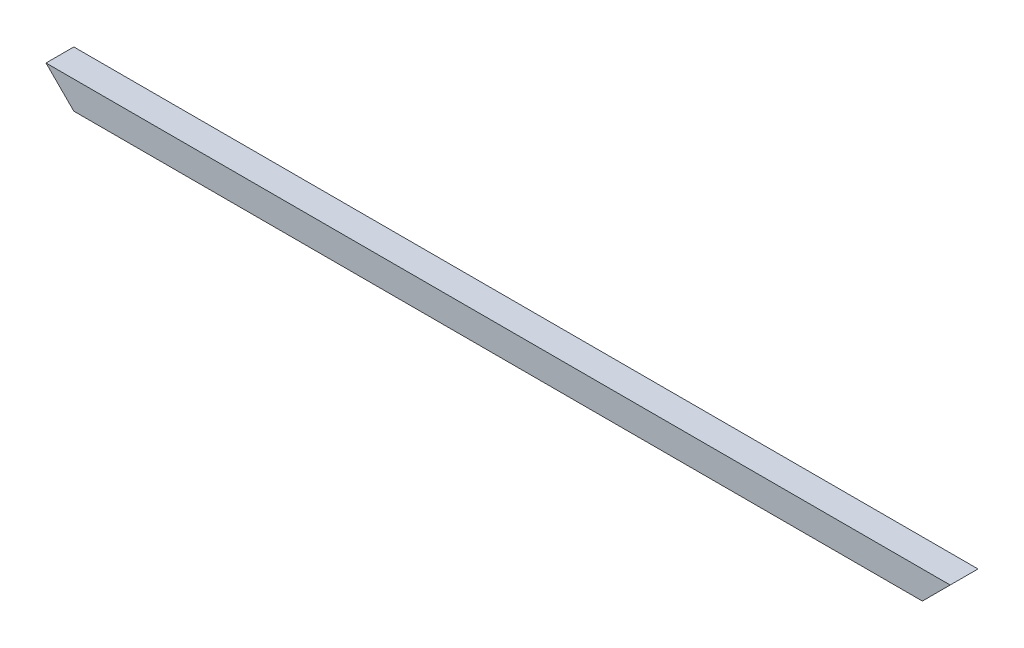
ISO-10303-21;
HEADER;
FILE_DESCRIPTION(('STEP AP214'),'2;1');
FILE_NAME('part.step','',(''),(''),'','','');
FILE_SCHEMA(('AUTOMOTIVE_DESIGN { 1 0 10303 214 1 1 1 1 }'));
ENDSEC;
DATA;
#1=APPLICATION_CONTEXT('core data for automotive mechanical design processes');
#2=APPLICATION_PROTOCOL_DEFINITION('international standard','automotive_design',2000,#1);
#3=PRODUCT_CONTEXT('',#1,'mechanical');
#4=PRODUCT('Part','Part','',(#3));
#5=PRODUCT_RELATED_PRODUCT_CATEGORY('part','',(#4));
#6=PRODUCT_DEFINITION_FORMATION('','',#4);
#7=PRODUCT_DEFINITION_CONTEXT('part definition',#1,'design');
#8=PRODUCT_DEFINITION('design','',#6,#7);
#9=PRODUCT_DEFINITION_SHAPE('','',#8);
#10=(LENGTH_UNIT() NAMED_UNIT(*) SI_UNIT(.MILLI.,.METRE.));
#11=(NAMED_UNIT(*) PLANE_ANGLE_UNIT() SI_UNIT($,.RADIAN.));
#12=(NAMED_UNIT(*) SI_UNIT($,.STERADIAN.) SOLID_ANGLE_UNIT());
#13=UNCERTAINTY_MEASURE_WITH_UNIT(LENGTH_MEASURE(1.E-05),#10,'distance_accuracy_value','');
#14=(GEOMETRIC_REPRESENTATION_CONTEXT(3) GLOBAL_UNCERTAINTY_ASSIGNED_CONTEXT((#13)) GLOBAL_UNIT_ASSIGNED_CONTEXT((#10,
#11,#12)) REPRESENTATION_CONTEXT('',''));
#15=CARTESIAN_POINT('',(0.,0.,0.));
#16=DIRECTION('',(0.,0.,1.));
#17=DIRECTION('',(1.,0.,0.));
#18=AXIS2_PLACEMENT_3D('',#15,#16,#17);
#19=CARTESIAN_POINT('',(650.,-10.,-10.));
#20=DIRECTION('',(0.,0.,1.));
#21=DIRECTION('',(1.,0.,0.));
#22=AXIS2_PLACEMENT_3D('',#19,#20,#21);
#23=PLANE('',#22);
#24=DIRECTION('',(-1.,0.,0.));
#25=VECTOR('',#24,1.);
#26=CARTESIAN_POINT('',(650.,10.,-10.));
#27=LINE('',#26,#25);
#28=CARTESIAN_POINT('',(650.,10.,-10.));
#29=VERTEX_POINT('',#28);
#30=CARTESIAN_POINT('',(0.,10.,-10.));
#31=VERTEX_POINT('',#30);
#32=EDGE_CURVE('E46',#29,#31,#27,.T.);
#33=ORIENTED_EDGE('',*,*,#32,.F.);
#34=DIRECTION('',(-0.707106781186544,-0.707106781186551,0.));
#35=VECTOR('',#34,1.);
#36=CARTESIAN_POINT('',(640.,-1.04083408558608E-13,-10.));
#37=LINE('',#36,#35);
#38=CARTESIAN_POINT('',(630.,-10.,-10.));
#39=VERTEX_POINT('',#38);
#40=EDGE_CURVE('E61',#29,#39,#37,.T.);
#41=ORIENTED_EDGE('',*,*,#40,.T.);
#42=DIRECTION('',(-1.,0.,0.));
#43=VECTOR('',#42,1.);
#44=CARTESIAN_POINT('',(650.,-10.,-10.));
#45=LINE('',#44,#43);
#46=CARTESIAN_POINT('',(19.9999999999998,-10.,-10.));
#47=VERTEX_POINT('',#46);
#48=EDGE_CURVE('E126',#39,#47,#45,.T.);
#49=ORIENTED_EDGE('',*,*,#48,.T.);
#50=DIRECTION('',(0.707106781186544,-0.707106781186551,0.));
#51=VECTOR('',#50,1.);
#52=CARTESIAN_POINT('',(334.999999999997,-325.,-10.));
#53=LINE('',#52,#51);
#54=EDGE_CURVE('E142',#31,#47,#53,.T.);
#55=ORIENTED_EDGE('',*,*,#54,.F.);
#56=EDGE_LOOP('',(#33,#41,#49,#55));
#57=FACE_BOUND('',#56,.T.);
#58=ADVANCED_FACE('F38',(#57),#23,.F.);
#59=CARTESIAN_POINT('',(650.,-10.,10.));
#60=DIRECTION('',(0.,0.,-1.));
#61=DIRECTION('',(-1.,0.,0.));
#62=AXIS2_PLACEMENT_3D('',#59,#60,#61);
#63=PLANE('',#62);
#64=DIRECTION('',(-1.,0.,0.));
#65=VECTOR('',#64,1.);
#66=CARTESIAN_POINT('',(650.,-10.,10.));
#67=LINE('',#66,#65);
#68=CARTESIAN_POINT('',(630.,-10.,10.));
#69=VERTEX_POINT('',#68);
#70=CARTESIAN_POINT('',(19.9999999999998,-10.,10.));
#71=VERTEX_POINT('',#70);
#72=EDGE_CURVE('E115',#69,#71,#67,.T.);
#73=ORIENTED_EDGE('',*,*,#72,.F.);
#74=DIRECTION('',(0.707106781186544,0.707106781186551,0.));
#75=VECTOR('',#74,1.);
#76=CARTESIAN_POINT('',(640.,-1.04083408558608E-13,10.));
#77=LINE('',#76,#75);
#78=CARTESIAN_POINT('',(650.,10.,10.));
#79=VERTEX_POINT('',#78);
#80=EDGE_CURVE('E118',#69,#79,#77,.T.);
#81=ORIENTED_EDGE('',*,*,#80,.T.);
#82=DIRECTION('',(-1.,0.,0.));
#83=VECTOR('',#82,1.);
#84=CARTESIAN_POINT('',(650.,10.,10.));
#85=LINE('',#84,#83);
#86=CARTESIAN_POINT('',(0.,10.,10.));
#87=VERTEX_POINT('',#86);
#88=EDGE_CURVE('E103',#79,#87,#85,.T.);
#89=ORIENTED_EDGE('',*,*,#88,.T.);
#90=DIRECTION('',(-0.707106781186544,0.707106781186551,0.));
#91=VECTOR('',#90,1.);
#92=CARTESIAN_POINT('',(334.999999999997,-325.,10.));
#93=LINE('',#92,#91);
#94=EDGE_CURVE('E143',#71,#87,#93,.T.);
#95=ORIENTED_EDGE('',*,*,#94,.F.);
#96=EDGE_LOOP('',(#73,#81,#89,#95));
#97=FACE_BOUND('',#96,.T.);
#98=ADVANCED_FACE('F119',(#97),#63,.F.);
#99=CARTESIAN_POINT('',(650.,-10.,10.));
#100=DIRECTION('',(0.,1.,0.));
#101=DIRECTION('',(0.,0.,1.));
#102=AXIS2_PLACEMENT_3D('',#99,#100,#101);
#103=PLANE('',#102);
#104=ORIENTED_EDGE('',*,*,#48,.F.);
#105=DIRECTION('',(0.,0.,1.));
#106=VECTOR('',#105,1.);
#107=CARTESIAN_POINT('',(630.,-10.,-823.268866980656));
#108=LINE('',#107,#106);
#109=EDGE_CURVE('E53',#39,#69,#108,.T.);
#110=ORIENTED_EDGE('',*,*,#109,.T.);
#111=ORIENTED_EDGE('',*,*,#72,.T.);
#112=DIRECTION('',(0.,0.,1.));
#113=VECTOR('',#112,1.);
#114=CARTESIAN_POINT('',(19.9999999999998,-10.,-823.268866980656));
#115=LINE('',#114,#113);
#116=EDGE_CURVE('E145',#47,#71,#115,.T.);
#117=ORIENTED_EDGE('',*,*,#116,.F.);
#118=EDGE_LOOP('',(#104,#110,#111,#117));
#119=FACE_BOUND('',#118,.T.);
#120=ADVANCED_FACE('F223',(#119),#103,.F.);
#121=CARTESIAN_POINT('',(650.,-8.8,8.8));
#122=DIRECTION('',(0.,0.,-1.));
#123=DIRECTION('',(-1.,0.,0.));
#124=AXIS2_PLACEMENT_3D('',#121,#122,#123);
#125=PLANE('',#124);
#126=DIRECTION('',(0.707106781186544,0.707106781186551,0.));
#127=VECTOR('',#126,1.);
#128=CARTESIAN_POINT('',(640.6,0.599999999999903,8.8));
#129=LINE('',#128,#127);
#130=CARTESIAN_POINT('',(631.2,-8.8,8.8));
#131=VERTEX_POINT('',#130);
#132=CARTESIAN_POINT('',(648.8,8.8,8.8));
#133=VERTEX_POINT('',#132);
#134=EDGE_CURVE('E122',#131,#133,#129,.T.);
#135=ORIENTED_EDGE('',*,*,#134,.F.);
#136=DIRECTION('',(-1.,0.,0.));
#137=VECTOR('',#136,1.);
#138=CARTESIAN_POINT('',(650.,-8.8,8.8));
#139=LINE('',#138,#137);
#140=CARTESIAN_POINT('',(18.7999999999998,-8.8,8.8));
#141=VERTEX_POINT('',#140);
#142=EDGE_CURVE('E131',#131,#141,#139,.T.);
#143=ORIENTED_EDGE('',*,*,#142,.T.);
#144=DIRECTION('',(-0.707106781186544,0.707106781186551,0.));
#145=VECTOR('',#144,1.);
#146=CARTESIAN_POINT('',(334.399999999997,-324.4,8.8));
#147=LINE('',#146,#145);
#148=CARTESIAN_POINT('',(1.19999999999998,8.8,8.8));
#149=VERTEX_POINT('',#148);
#150=EDGE_CURVE('E147',#141,#149,#147,.T.);
#151=ORIENTED_EDGE('',*,*,#150,.T.);
#152=DIRECTION('',(-1.,0.,0.));
#153=VECTOR('',#152,1.);
#154=CARTESIAN_POINT('',(650.,8.8,8.8));
#155=LINE('',#154,#153);
#156=EDGE_CURVE('E151',#133,#149,#155,.T.);
#157=ORIENTED_EDGE('',*,*,#156,.F.);
#158=EDGE_LOOP('',(#135,#143,#151,#157));
#159=FACE_BOUND('',#158,.T.);
#160=ADVANCED_FACE('F172',(#159),#125,.T.);
#161=CARTESIAN_POINT('',(650.,-8.8,8.8));
#162=DIRECTION('',(0.,1.,0.));
#163=DIRECTION('',(0.,0.,1.));
#164=AXIS2_PLACEMENT_3D('',#161,#162,#163);
#165=PLANE('',#164);
#166=DIRECTION('',(0.,0.,1.));
#167=VECTOR('',#166,1.);
#168=CARTESIAN_POINT('',(631.2,-8.8,8.8));
#169=LINE('',#168,#167);
#170=CARTESIAN_POINT('',(631.2,-8.80000000000001,-8.8));
#171=VERTEX_POINT('',#170);
#172=EDGE_CURVE('E192',#171,#131,#169,.T.);
#173=ORIENTED_EDGE('',*,*,#172,.F.);
#174=DIRECTION('',(-1.,0.,0.));
#175=VECTOR('',#174,1.);
#176=CARTESIAN_POINT('',(650.,-8.8,-8.8));
#177=LINE('',#176,#175);
#178=CARTESIAN_POINT('',(18.7999999999997,-8.79999999999997,-8.8));
#179=VERTEX_POINT('',#178);
#180=EDGE_CURVE('E162',#171,#179,#177,.T.);
#181=ORIENTED_EDGE('',*,*,#180,.T.);
#182=DIRECTION('',(0.,0.,1.));
#183=VECTOR('',#182,1.);
#184=CARTESIAN_POINT('',(18.7999999999998,-8.8,8.8));
#185=LINE('',#184,#183);
#186=EDGE_CURVE('E154',#179,#141,#185,.T.);
#187=ORIENTED_EDGE('',*,*,#186,.T.);
#188=ORIENTED_EDGE('',*,*,#142,.F.);
#189=EDGE_LOOP('',(#173,#181,#187,#188));
#190=FACE_BOUND('',#189,.T.);
#191=ADVANCED_FACE('F180',(#190),#165,.T.);
#192=CARTESIAN_POINT('',(650.,-8.8,-8.8));
#193=DIRECTION('',(0.,0.,1.));
#194=DIRECTION('',(1.,0.,0.));
#195=AXIS2_PLACEMENT_3D('',#192,#193,#194);
#196=PLANE('',#195);
#197=DIRECTION('',(-0.707106781186544,-0.707106781186551,0.));
#198=VECTOR('',#197,1.);
#199=CARTESIAN_POINT('',(640.6,0.599999999999903,-8.8));
#200=LINE('',#199,#198);
#201=CARTESIAN_POINT('',(648.8,8.8,-8.8));
#202=VERTEX_POINT('',#201);
#203=EDGE_CURVE('E195',#202,#171,#200,.T.);
#204=ORIENTED_EDGE('',*,*,#203,.F.);
#205=DIRECTION('',(-1.,0.,0.));
#206=VECTOR('',#205,1.);
#207=CARTESIAN_POINT('',(650.,8.8,-8.8));
#208=LINE('',#207,#206);
#209=CARTESIAN_POINT('',(1.19999999999998,8.8,-8.8));
#210=VERTEX_POINT('',#209);
#211=EDGE_CURVE('E160',#202,#210,#208,.T.);
#212=ORIENTED_EDGE('',*,*,#211,.T.);
#213=DIRECTION('',(0.707106781186544,-0.707106781186551,0.));
#214=VECTOR('',#213,1.);
#215=CARTESIAN_POINT('',(334.399999999997,-324.4,-8.8));
#216=LINE('',#215,#214);
#217=EDGE_CURVE('E182',#210,#179,#216,.T.);
#218=ORIENTED_EDGE('',*,*,#217,.T.);
#219=ORIENTED_EDGE('',*,*,#180,.F.);
#220=EDGE_LOOP('',(#204,#212,#218,#219));
#221=FACE_BOUND('',#220,.T.);
#222=ADVANCED_FACE('F209',(#221),#196,.T.);
#223=CARTESIAN_POINT('',(650.,8.8,8.8));
#224=DIRECTION('',(0.,-1.,0.));
#225=DIRECTION('',(0.,0.,-1.));
#226=AXIS2_PLACEMENT_3D('',#223,#224,#225);
#227=PLANE('',#226);
#228=DIRECTION('',(0.,0.,-1.));
#229=VECTOR('',#228,1.);
#230=CARTESIAN_POINT('',(648.8,8.8,8.8));
#231=LINE('',#230,#229);
#232=EDGE_CURVE('E199',#133,#202,#231,.T.);
#233=ORIENTED_EDGE('',*,*,#232,.F.);
#234=ORIENTED_EDGE('',*,*,#156,.T.);
#235=DIRECTION('',(0.,0.,-1.));
#236=VECTOR('',#235,1.);
#237=CARTESIAN_POINT('',(1.19999999999998,8.8,8.8));
#238=LINE('',#237,#236);
#239=EDGE_CURVE('E11',#149,#210,#238,.T.);
#240=ORIENTED_EDGE('',*,*,#239,.T.);
#241=ORIENTED_EDGE('',*,*,#211,.F.);
#242=EDGE_LOOP('',(#233,#234,#240,#241));
#243=FACE_BOUND('',#242,.T.);
#244=ADVANCED_FACE('F207',(#243),#227,.T.);
#245=CARTESIAN_POINT('',(650.,10.,10.));
#246=DIRECTION('',(0.,-1.,0.));
#247=DIRECTION('',(0.,0.,-1.));
#248=AXIS2_PLACEMENT_3D('',#245,#246,#247);
#249=PLANE('',#248);
#250=DIRECTION('',(0.,0.,1.));
#251=VECTOR('',#250,1.);
#252=CARTESIAN_POINT('',(0.,10.,10.));
#253=LINE('',#252,#251);
#254=EDGE_CURVE('E110',#31,#87,#253,.T.);
#255=ORIENTED_EDGE('',*,*,#254,.T.);
#256=ORIENTED_EDGE('',*,*,#88,.F.);
#257=DIRECTION('',(0.,0.,1.));
#258=VECTOR('',#257,1.);
#259=CARTESIAN_POINT('',(650.,10.,10.));
#260=LINE('',#259,#258);
#261=EDGE_CURVE('E108',#29,#79,#260,.T.);
#262=ORIENTED_EDGE('',*,*,#261,.F.);
#263=ORIENTED_EDGE('',*,*,#32,.T.);
#264=EDGE_LOOP('',(#255,#256,#262,#263));
#265=FACE_BOUND('',#264,.T.);
#266=ADVANCED_FACE('F105',(#265),#249,.F.);
#267=CARTESIAN_POINT('',(0.,10.,-823.268866980656));
#268=DIRECTION('',(-0.707106781186551,-0.707106781186544,0.));
#269=DIRECTION('',(0.707106781186544,-0.707106781186551,0.));
#270=AXIS2_PLACEMENT_3D('',#267,#268,#269);
#271=PLANE('',#270);
#272=ORIENTED_EDGE('',*,*,#150,.F.);
#273=ORIENTED_EDGE('',*,*,#186,.F.);
#274=ORIENTED_EDGE('',*,*,#217,.F.);
#275=ORIENTED_EDGE('',*,*,#239,.F.);
#276=EDGE_LOOP('',(#272,#273,#274,#275));
#277=FACE_BOUND('',#276,.T.);
#278=ORIENTED_EDGE('',*,*,#254,.F.);
#279=ORIENTED_EDGE('',*,*,#54,.T.);
#280=ORIENTED_EDGE('',*,*,#116,.T.);
#281=ORIENTED_EDGE('',*,*,#94,.T.);
#282=EDGE_LOOP('',(#278,#279,#280,#281));
#283=FACE_BOUND('',#282,.T.);
#284=ADVANCED_FACE('F140',(#277,#283),#271,.T.);
#285=CARTESIAN_POINT('',(650.,10.,-823.268866980656));
#286=DIRECTION('',(-0.707106781186551,0.707106781186544,0.));
#287=DIRECTION('',(-0.707106781186544,-0.707106781186551,0.));
#288=AXIS2_PLACEMENT_3D('',#285,#286,#287);
#289=PLANE('',#288);
#290=ORIENTED_EDGE('',*,*,#172,.T.);
#291=ORIENTED_EDGE('',*,*,#134,.T.);
#292=ORIENTED_EDGE('',*,*,#232,.T.);
#293=ORIENTED_EDGE('',*,*,#203,.T.);
#294=EDGE_LOOP('',(#290,#291,#292,#293));
#295=FACE_BOUND('',#294,.T.);
#296=ORIENTED_EDGE('',*,*,#40,.F.);
#297=ORIENTED_EDGE('',*,*,#261,.T.);
#298=ORIENTED_EDGE('',*,*,#80,.F.);
#299=ORIENTED_EDGE('',*,*,#109,.F.);
#300=EDGE_LOOP('',(#296,#297,#298,#299));
#301=FACE_BOUND('',#300,.T.);
#302=ADVANCED_FACE('F124',(#295,#301),#289,.F.);
#303=CLOSED_SHELL('',(#58,#98,#120,#160,#191,#222,#244,#266,#284,#302));
#304=MANIFOLD_SOLID_BREP('B2',#303);
#305=ADVANCED_BREP_SHAPE_REPRESENTATION('',(#18,#304),#14);
#306=SHAPE_DEFINITION_REPRESENTATION(#9,#305);
ENDSEC;
END-ISO-10303-21;
